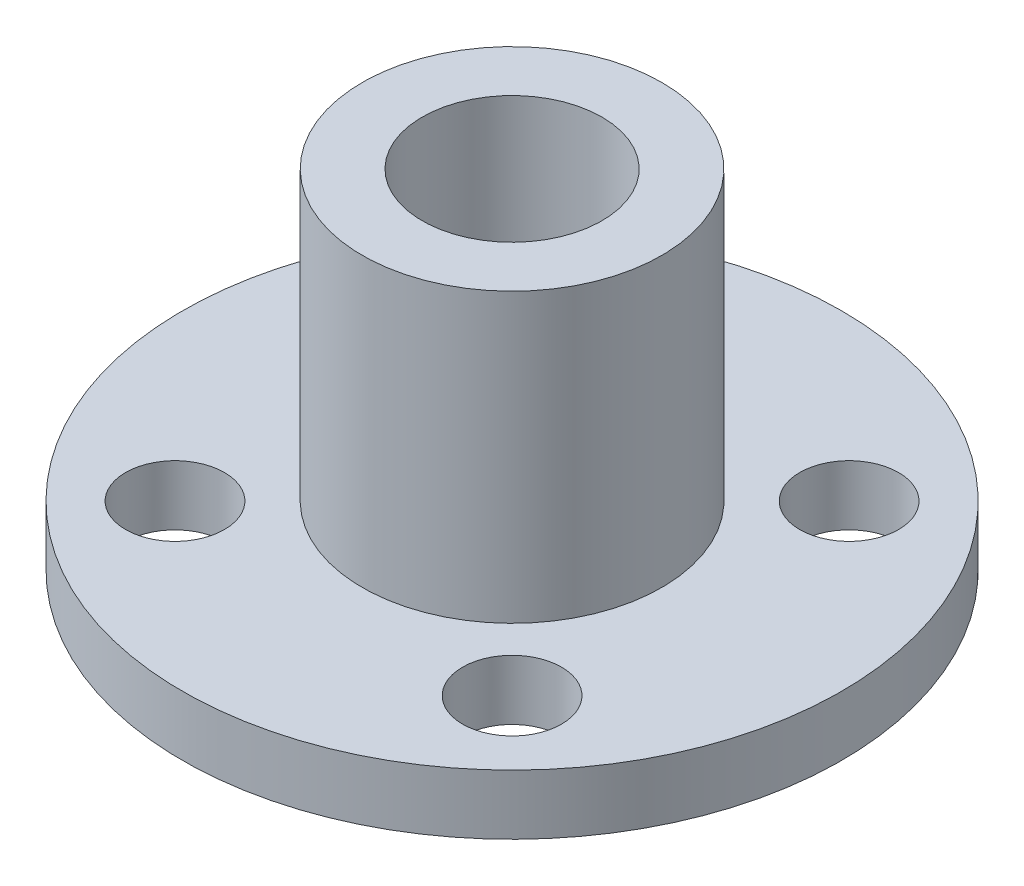
ISO-10303-21;
HEADER;
FILE_DESCRIPTION(('STEP AP214'),'2;1');
FILE_NAME('part.step','',(''),(''),'','','');
FILE_SCHEMA(('AUTOMOTIVE_DESIGN { 1 0 10303 214 1 1 1 1 }'));
ENDSEC;
DATA;
#1=APPLICATION_CONTEXT('core data for automotive mechanical design processes');
#2=APPLICATION_PROTOCOL_DEFINITION('international standard','automotive_design',2000,#1);
#3=PRODUCT_CONTEXT('',#1,'mechanical');
#4=PRODUCT('Part','Part','',(#3));
#5=PRODUCT_RELATED_PRODUCT_CATEGORY('part','',(#4));
#6=PRODUCT_DEFINITION_FORMATION('','',#4);
#7=PRODUCT_DEFINITION_CONTEXT('part definition',#1,'design');
#8=PRODUCT_DEFINITION('design','',#6,#7);
#9=PRODUCT_DEFINITION_SHAPE('','',#8);
#10=(LENGTH_UNIT() NAMED_UNIT(*) SI_UNIT(.MILLI.,.METRE.));
#11=(NAMED_UNIT(*) PLANE_ANGLE_UNIT() SI_UNIT($,.RADIAN.));
#12=(NAMED_UNIT(*) SI_UNIT($,.STERADIAN.) SOLID_ANGLE_UNIT());
#13=UNCERTAINTY_MEASURE_WITH_UNIT(LENGTH_MEASURE(1.E-05),#10,'distance_accuracy_value','');
#14=(GEOMETRIC_REPRESENTATION_CONTEXT(3) GLOBAL_UNCERTAINTY_ASSIGNED_CONTEXT((#13)) GLOBAL_UNIT_ASSIGNED_CONTEXT((#10,
#11,#12)) REPRESENTATION_CONTEXT('',''));
#15=CARTESIAN_POINT('',(0.,0.,0.));
#16=DIRECTION('',(0.,0.,1.));
#17=DIRECTION('',(1.,0.,0.));
#18=AXIS2_PLACEMENT_3D('',#15,#16,#17);
#19=CARTESIAN_POINT('',(5.,11.6,0.));
#20=DIRECTION('',(0.,1.,0.));
#21=DIRECTION('',(0.,0.,1.));
#22=AXIS2_PLACEMENT_3D('',#19,#20,#21);
#23=PLANE('',#22);
#24=CARTESIAN_POINT('',(0.,11.6,0.));
#25=DIRECTION('',(0.,-1.,0.));
#26=DIRECTION('',(0.,0.,-1.));
#27=AXIS2_PLACEMENT_3D('',#24,#25,#26);
#28=CIRCLE('',#27,3.);
#29=CARTESIAN_POINT('',(0.,11.6,-3.));
#30=VERTEX_POINT('',#29);
#31=EDGE_CURVE('E10',#30,#30,#28,.T.);
#32=ORIENTED_EDGE('',*,*,#31,.T.);
#33=EDGE_LOOP('',(#32));
#34=FACE_BOUND('',#33,.T.);
#35=CARTESIAN_POINT('',(0.,11.6,0.));
#36=DIRECTION('',(0.,-1.,0.));
#37=DIRECTION('',(0.,0.,-1.));
#38=AXIS2_PLACEMENT_3D('',#35,#36,#37);
#39=CIRCLE('',#38,5.);
#40=CARTESIAN_POINT('',(0.,11.6,-5.));
#41=VERTEX_POINT('',#40);
#42=EDGE_CURVE('E70',#41,#41,#39,.T.);
#43=ORIENTED_EDGE('',*,*,#42,.F.);
#44=EDGE_LOOP('',(#43));
#45=FACE_BOUND('',#44,.T.);
#46=ADVANCED_FACE('F37',(#34,#45),#23,.T.);
#47=CARTESIAN_POINT('',(0.,0.,0.));
#48=DIRECTION('',(0.,-1.,0.));
#49=DIRECTION('',(0.,0.,-1.));
#50=AXIS2_PLACEMENT_3D('',#47,#48,#49);
#51=CYLINDRICAL_SURFACE('',#50,3.);
#52=CARTESIAN_POINT('',(0.,0.,0.));
#53=DIRECTION('',(0.,-1.,0.));
#54=DIRECTION('',(0.,0.,-1.));
#55=AXIS2_PLACEMENT_3D('',#52,#53,#54);
#56=CIRCLE('',#55,3.);
#57=CARTESIAN_POINT('',(0.,0.,-3.));
#58=VERTEX_POINT('',#57);
#59=EDGE_CURVE('E45',#58,#58,#56,.T.);
#60=ORIENTED_EDGE('',*,*,#59,.T.);
#61=EDGE_LOOP('',(#60));
#62=FACE_BOUND('',#61,.T.);
#63=ORIENTED_EDGE('',*,*,#31,.F.);
#64=EDGE_LOOP('',(#63));
#65=FACE_BOUND('',#64,.T.);
#66=ADVANCED_FACE('F107',(#62,#65),#51,.F.);
#67=CARTESIAN_POINT('',(3.,0.,0.));
#68=DIRECTION('',(0.,-1.,0.));
#69=DIRECTION('',(0.,0.,-1.));
#70=AXIS2_PLACEMENT_3D('',#67,#68,#69);
#71=PLANE('',#70);
#72=CARTESIAN_POINT('',(-5.625,0.,-5.625));
#73=DIRECTION('',(0.,-1.,0.));
#74=DIRECTION('',(0.,0.,-1.));
#75=AXIS2_PLACEMENT_3D('',#72,#73,#74);
#76=CIRCLE('',#75,1.65);
#77=CARTESIAN_POINT('',(-5.625,0.,-7.275));
#78=VERTEX_POINT('',#77);
#79=EDGE_CURVE('E187',#78,#78,#76,.T.);
#80=ORIENTED_EDGE('',*,*,#79,.F.);
#81=EDGE_LOOP('',(#80));
#82=FACE_BOUND('',#81,.T.);
#83=CARTESIAN_POINT('',(5.625,0.,-5.625));
#84=DIRECTION('',(0.,-1.,0.));
#85=DIRECTION('',(0.,0.,-1.));
#86=AXIS2_PLACEMENT_3D('',#83,#84,#85);
#87=CIRCLE('',#86,1.65);
#88=CARTESIAN_POINT('',(5.625,0.,-7.275));
#89=VERTEX_POINT('',#88);
#90=EDGE_CURVE('E189',#89,#89,#87,.T.);
#91=ORIENTED_EDGE('',*,*,#90,.F.);
#92=EDGE_LOOP('',(#91));
#93=FACE_BOUND('',#92,.T.);
#94=CARTESIAN_POINT('',(5.625,0.,5.625));
#95=DIRECTION('',(0.,-1.,0.));
#96=DIRECTION('',(0.,0.,-1.));
#97=AXIS2_PLACEMENT_3D('',#94,#95,#96);
#98=CIRCLE('',#97,1.65);
#99=CARTESIAN_POINT('',(5.625,0.,3.975));
#100=VERTEX_POINT('',#99);
#101=EDGE_CURVE('E192',#100,#100,#98,.T.);
#102=ORIENTED_EDGE('',*,*,#101,.F.);
#103=EDGE_LOOP('',(#102));
#104=FACE_BOUND('',#103,.T.);
#105=CARTESIAN_POINT('',(-5.625,0.,5.625));
#106=DIRECTION('',(0.,-1.,0.));
#107=DIRECTION('',(0.,0.,-1.));
#108=AXIS2_PLACEMENT_3D('',#105,#106,#107);
#109=CIRCLE('',#108,1.65);
#110=CARTESIAN_POINT('',(-5.625,0.,3.975));
#111=VERTEX_POINT('',#110);
#112=EDGE_CURVE('E60',#111,#111,#109,.T.);
#113=ORIENTED_EDGE('',*,*,#112,.F.);
#114=EDGE_LOOP('',(#113));
#115=FACE_BOUND('',#114,.T.);
#116=CARTESIAN_POINT('',(0.,0.,0.));
#117=DIRECTION('',(0.,-1.,0.));
#118=DIRECTION('',(0.,0.,-1.));
#119=AXIS2_PLACEMENT_3D('',#116,#117,#118);
#120=CIRCLE('',#119,11.);
#121=CARTESIAN_POINT('',(0.,0.,-11.));
#122=VERTEX_POINT('',#121);
#123=EDGE_CURVE('E51',#122,#122,#120,.T.);
#124=ORIENTED_EDGE('',*,*,#123,.T.);
#125=EDGE_LOOP('',(#124));
#126=FACE_BOUND('',#125,.T.);
#127=ORIENTED_EDGE('',*,*,#59,.F.);
#128=EDGE_LOOP('',(#127));
#129=FACE_BOUND('',#128,.T.);
#130=ADVANCED_FACE('F92',(#82,#93,#104,#115,#126,#129),#71,.T.);
#131=CARTESIAN_POINT('',(0.,0.,0.));
#132=DIRECTION('',(0.,-1.,0.));
#133=DIRECTION('',(0.,0.,-1.));
#134=AXIS2_PLACEMENT_3D('',#131,#132,#133);
#135=CYLINDRICAL_SURFACE('',#134,11.);
#136=CARTESIAN_POINT('',(0.,2.,0.));
#137=DIRECTION('',(0.,-1.,0.));
#138=DIRECTION('',(0.,0.,-1.));
#139=AXIS2_PLACEMENT_3D('',#136,#137,#138);
#140=CIRCLE('',#139,11.);
#141=CARTESIAN_POINT('',(0.,2.,-11.));
#142=VERTEX_POINT('',#141);
#143=EDGE_CURVE('E81',#142,#142,#140,.T.);
#144=ORIENTED_EDGE('',*,*,#143,.T.);
#145=EDGE_LOOP('',(#144));
#146=FACE_BOUND('',#145,.T.);
#147=ORIENTED_EDGE('',*,*,#123,.F.);
#148=EDGE_LOOP('',(#147));
#149=FACE_BOUND('',#148,.T.);
#150=ADVANCED_FACE('F95',(#146,#149),#135,.T.);
#151=CARTESIAN_POINT('',(11.,2.,0.));
#152=DIRECTION('',(0.,1.,0.));
#153=DIRECTION('',(0.,0.,1.));
#154=AXIS2_PLACEMENT_3D('',#151,#152,#153);
#155=PLANE('',#154);
#156=CARTESIAN_POINT('',(-5.625,2.,-5.625));
#157=DIRECTION('',(0.,1.,0.));
#158=DIRECTION('',(0.,0.,1.));
#159=AXIS2_PLACEMENT_3D('',#156,#157,#158);
#160=CIRCLE('',#159,1.65);
#161=CARTESIAN_POINT('',(-5.625,2.,-3.975));
#162=VERTEX_POINT('',#161);
#163=EDGE_CURVE('E40',#162,#162,#160,.T.);
#164=ORIENTED_EDGE('',*,*,#163,.F.);
#165=EDGE_LOOP('',(#164));
#166=FACE_BOUND('',#165,.T.);
#167=CARTESIAN_POINT('',(5.625,2.,-5.625));
#168=DIRECTION('',(0.,1.,0.));
#169=DIRECTION('',(0.,0.,1.));
#170=AXIS2_PLACEMENT_3D('',#167,#168,#169);
#171=CIRCLE('',#170,1.65);
#172=CARTESIAN_POINT('',(5.625,2.,-3.975));
#173=VERTEX_POINT('',#172);
#174=EDGE_CURVE('E63',#173,#173,#171,.T.);
#175=ORIENTED_EDGE('',*,*,#174,.F.);
#176=EDGE_LOOP('',(#175));
#177=FACE_BOUND('',#176,.T.);
#178=CARTESIAN_POINT('',(5.625,2.,5.625));
#179=DIRECTION('',(0.,1.,0.));
#180=DIRECTION('',(0.,0.,1.));
#181=AXIS2_PLACEMENT_3D('',#178,#179,#180);
#182=CIRCLE('',#181,1.65);
#183=CARTESIAN_POINT('',(5.625,2.,7.275));
#184=VERTEX_POINT('',#183);
#185=EDGE_CURVE('E59',#184,#184,#182,.T.);
#186=ORIENTED_EDGE('',*,*,#185,.F.);
#187=EDGE_LOOP('',(#186));
#188=FACE_BOUND('',#187,.T.);
#189=CARTESIAN_POINT('',(-5.625,2.,5.625));
#190=DIRECTION('',(0.,1.,0.));
#191=DIRECTION('',(0.,0.,1.));
#192=AXIS2_PLACEMENT_3D('',#189,#190,#191);
#193=CIRCLE('',#192,1.65);
#194=CARTESIAN_POINT('',(-5.625,2.,7.275));
#195=VERTEX_POINT('',#194);
#196=EDGE_CURVE('E55',#195,#195,#193,.T.);
#197=ORIENTED_EDGE('',*,*,#196,.F.);
#198=EDGE_LOOP('',(#197));
#199=FACE_BOUND('',#198,.T.);
#200=CARTESIAN_POINT('',(0.,2.,0.));
#201=DIRECTION('',(0.,-1.,0.));
#202=DIRECTION('',(0.,0.,-1.));
#203=AXIS2_PLACEMENT_3D('',#200,#201,#202);
#204=CIRCLE('',#203,5.);
#205=CARTESIAN_POINT('',(0.,2.,-5.));
#206=VERTEX_POINT('',#205);
#207=EDGE_CURVE('E75',#206,#206,#204,.T.);
#208=ORIENTED_EDGE('',*,*,#207,.T.);
#209=EDGE_LOOP('',(#208));
#210=FACE_BOUND('',#209,.T.);
#211=ORIENTED_EDGE('',*,*,#143,.F.);
#212=EDGE_LOOP('',(#211));
#213=FACE_BOUND('',#212,.T.);
#214=ADVANCED_FACE('F97',(#166,#177,#188,#199,#210,#213),#155,.T.);
#215=CARTESIAN_POINT('',(0.,0.,0.));
#216=DIRECTION('',(0.,-1.,0.));
#217=DIRECTION('',(0.,0.,-1.));
#218=AXIS2_PLACEMENT_3D('',#215,#216,#217);
#219=CYLINDRICAL_SURFACE('',#218,5.);
#220=ORIENTED_EDGE('',*,*,#42,.T.);
#221=EDGE_LOOP('',(#220));
#222=FACE_BOUND('',#221,.T.);
#223=ORIENTED_EDGE('',*,*,#207,.F.);
#224=EDGE_LOOP('',(#223));
#225=FACE_BOUND('',#224,.T.);
#226=ADVANCED_FACE('F104',(#222,#225),#219,.T.);
#227=CARTESIAN_POINT('',(-5.625,11.6,5.625));
#228=DIRECTION('',(0.,-1.,0.));
#229=DIRECTION('',(0.,0.,-1.));
#230=AXIS2_PLACEMENT_3D('',#227,#228,#229);
#231=CYLINDRICAL_SURFACE('',#230,1.65);
#232=ORIENTED_EDGE('',*,*,#196,.T.);
#233=EDGE_LOOP('',(#232));
#234=FACE_BOUND('',#233,.T.);
#235=ORIENTED_EDGE('',*,*,#112,.T.);
#236=EDGE_LOOP('',(#235));
#237=FACE_BOUND('',#236,.T.);
#238=ADVANCED_FACE('F140',(#234,#237),#231,.F.);
#239=CARTESIAN_POINT('',(5.625,11.6,5.625));
#240=DIRECTION('',(0.,-1.,0.));
#241=DIRECTION('',(0.,0.,-1.));
#242=AXIS2_PLACEMENT_3D('',#239,#240,#241);
#243=CYLINDRICAL_SURFACE('',#242,1.65);
#244=ORIENTED_EDGE('',*,*,#185,.T.);
#245=EDGE_LOOP('',(#244));
#246=FACE_BOUND('',#245,.T.);
#247=ORIENTED_EDGE('',*,*,#101,.T.);
#248=EDGE_LOOP('',(#247));
#249=FACE_BOUND('',#248,.T.);
#250=ADVANCED_FACE('F145',(#246,#249),#243,.F.);
#251=CARTESIAN_POINT('',(5.625,11.6,-5.625));
#252=DIRECTION('',(0.,-1.,0.));
#253=DIRECTION('',(0.,0.,-1.));
#254=AXIS2_PLACEMENT_3D('',#251,#252,#253);
#255=CYLINDRICAL_SURFACE('',#254,1.65);
#256=ORIENTED_EDGE('',*,*,#174,.T.);
#257=EDGE_LOOP('',(#256));
#258=FACE_BOUND('',#257,.T.);
#259=ORIENTED_EDGE('',*,*,#90,.T.);
#260=EDGE_LOOP('',(#259));
#261=FACE_BOUND('',#260,.T.);
#262=ADVANCED_FACE('F155',(#258,#261),#255,.F.);
#263=CARTESIAN_POINT('',(-5.625,11.6,-5.625));
#264=DIRECTION('',(0.,-1.,0.));
#265=DIRECTION('',(0.,0.,-1.));
#266=AXIS2_PLACEMENT_3D('',#263,#264,#265);
#267=CYLINDRICAL_SURFACE('',#266,1.65);
#268=ORIENTED_EDGE('',*,*,#163,.T.);
#269=EDGE_LOOP('',(#268));
#270=FACE_BOUND('',#269,.T.);
#271=ORIENTED_EDGE('',*,*,#79,.T.);
#272=EDGE_LOOP('',(#271));
#273=FACE_BOUND('',#272,.T.);
#274=ADVANCED_FACE('F165',(#270,#273),#267,.F.);
#275=CLOSED_SHELL('',(#46,#66,#130,#150,#214,#226,#238,#250,#262,#274));
#276=MANIFOLD_SOLID_BREP('B2',#275);
#277=ADVANCED_BREP_SHAPE_REPRESENTATION('',(#18,#276),#14);
#278=SHAPE_DEFINITION_REPRESENTATION(#9,#277);
ENDSEC;
END-ISO-10303-21;
